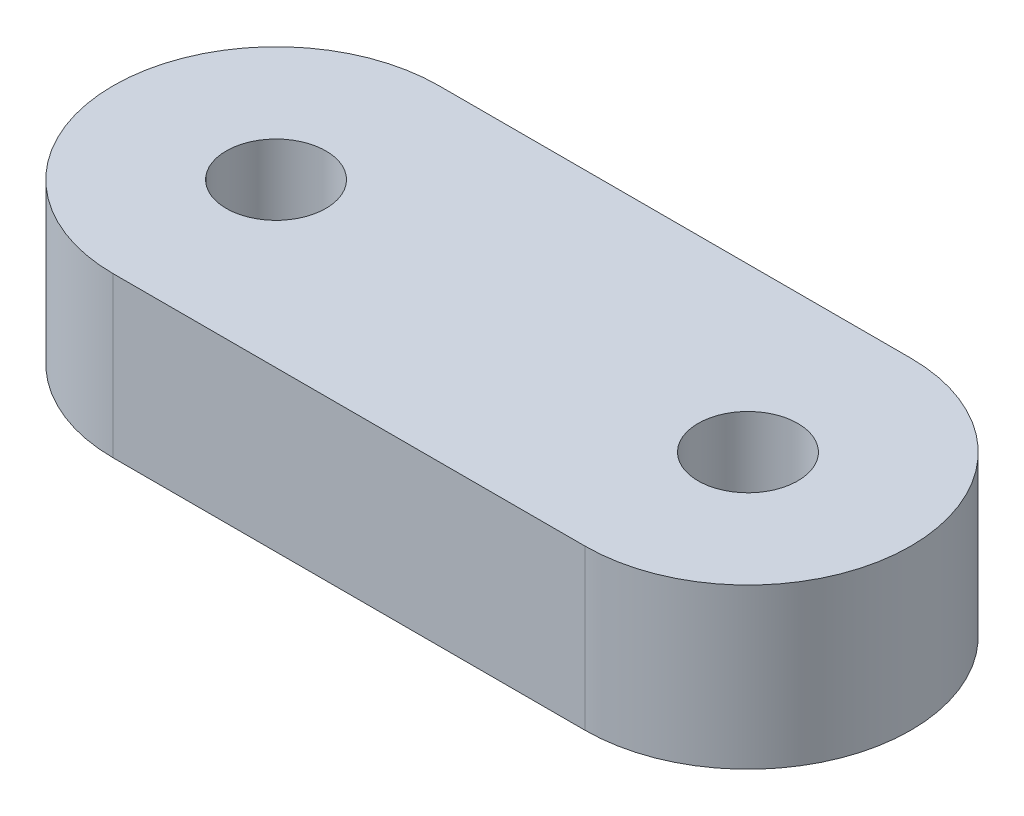
ISO-10303-21;
HEADER;
FILE_DESCRIPTION(('STEP AP214'),'2;1');
FILE_NAME('part.step','',(''),(''),'','','');
FILE_SCHEMA(('AUTOMOTIVE_DESIGN { 1 0 10303 214 1 1 1 1 }'));
ENDSEC;
DATA;
#1=APPLICATION_CONTEXT('core data for automotive mechanical design processes');
#2=APPLICATION_PROTOCOL_DEFINITION('international standard','automotive_design',2000,#1);
#3=PRODUCT_CONTEXT('',#1,'mechanical');
#4=PRODUCT('Part','Part','',(#3));
#5=PRODUCT_RELATED_PRODUCT_CATEGORY('part','',(#4));
#6=PRODUCT_DEFINITION_FORMATION('','',#4);
#7=PRODUCT_DEFINITION_CONTEXT('part definition',#1,'design');
#8=PRODUCT_DEFINITION('design','',#6,#7);
#9=PRODUCT_DEFINITION_SHAPE('','',#8);
#10=(LENGTH_UNIT() NAMED_UNIT(*) SI_UNIT(.MILLI.,.METRE.));
#11=(NAMED_UNIT(*) PLANE_ANGLE_UNIT() SI_UNIT($,.RADIAN.));
#12=(NAMED_UNIT(*) SI_UNIT($,.STERADIAN.) SOLID_ANGLE_UNIT());
#13=UNCERTAINTY_MEASURE_WITH_UNIT(LENGTH_MEASURE(1.E-05),#10,'distance_accuracy_value','');
#14=(GEOMETRIC_REPRESENTATION_CONTEXT(3) GLOBAL_UNCERTAINTY_ASSIGNED_CONTEXT((#13)) GLOBAL_UNIT_ASSIGNED_CONTEXT((#10,
#11,#12)) REPRESENTATION_CONTEXT('',''));
#15=CARTESIAN_POINT('',(0.,0.,0.));
#16=DIRECTION('',(0.,0.,1.));
#17=DIRECTION('',(1.,0.,0.));
#18=AXIS2_PLACEMENT_3D('',#15,#16,#17);
#19=CARTESIAN_POINT('',(7.1,4.8,0.));
#20=DIRECTION('',(0.,1.,0.));
#21=DIRECTION('',(0.,0.,1.));
#22=AXIS2_PLACEMENT_3D('',#19,#20,#21);
#23=PLANE('',#22);
#24=CARTESIAN_POINT('',(-7.1,4.8,0.));
#25=DIRECTION('',(0.,1.,0.));
#26=DIRECTION('',(0.,0.,1.));
#27=AXIS2_PLACEMENT_3D('',#24,#25,#26);
#28=CIRCLE('',#27,1.5);
#29=CARTESIAN_POINT('',(-7.1,4.8,1.5));
#30=VERTEX_POINT('',#29);
#31=EDGE_CURVE('E100',#30,#30,#28,.T.);
#32=ORIENTED_EDGE('',*,*,#31,.F.);
#33=EDGE_LOOP('',(#32));
#34=FACE_BOUND('',#33,.T.);
#35=CARTESIAN_POINT('',(7.1,4.8,0.));
#36=DIRECTION('',(0.,1.,0.));
#37=DIRECTION('',(0.,0.,1.));
#38=AXIS2_PLACEMENT_3D('',#35,#36,#37);
#39=CIRCLE('',#38,4.90000000000003);
#40=CARTESIAN_POINT('',(7.09999944181255,4.8,4.9));
#41=VERTEX_POINT('',#40);
#42=CARTESIAN_POINT('',(7.09999944181255,4.8,-4.9));
#43=VERTEX_POINT('',#42);
#44=EDGE_CURVE('E85',#41,#43,#39,.T.);
#45=ORIENTED_EDGE('',*,*,#44,.T.);
#46=DIRECTION('',(-1.,0.,0.));
#47=VECTOR('',#46,1.);
#48=CARTESIAN_POINT('',(-7.09999944181255,4.8,-4.9));
#49=LINE('',#48,#47);
#50=CARTESIAN_POINT('',(-7.09999944181255,4.8,-4.9));
#51=VERTEX_POINT('',#50);
#52=EDGE_CURVE('E80',#43,#51,#49,.T.);
#53=ORIENTED_EDGE('',*,*,#52,.T.);
#54=CARTESIAN_POINT('',(-7.1,4.8,0.));
#55=DIRECTION('',(0.,1.,0.));
#56=DIRECTION('',(0.,0.,1.));
#57=AXIS2_PLACEMENT_3D('',#54,#55,#56);
#58=CIRCLE('',#57,4.90000000000003);
#59=CARTESIAN_POINT('',(-7.09999944181255,4.8,4.90000000000001));
#60=VERTEX_POINT('',#59);
#61=EDGE_CURVE('E83',#51,#60,#58,.T.);
#62=ORIENTED_EDGE('',*,*,#61,.T.);
#63=DIRECTION('',(1.,0.,0.));
#64=VECTOR('',#63,1.);
#65=CARTESIAN_POINT('',(-7.09999944181255,4.8,4.90000000000001));
#66=LINE('',#65,#64);
#67=EDGE_CURVE('E50',#60,#41,#66,.T.);
#68=ORIENTED_EDGE('',*,*,#67,.T.);
#69=EDGE_LOOP('',(#45,#53,#62,#68));
#70=FACE_BOUND('',#69,.T.);
#71=CARTESIAN_POINT('',(7.1,4.8,0.));
#72=DIRECTION('',(0.,1.,0.));
#73=DIRECTION('',(0.,0.,-1.));
#74=AXIS2_PLACEMENT_3D('',#71,#72,#73);
#75=CIRCLE('',#74,1.5);
#76=CARTESIAN_POINT('',(7.1,4.8,-1.5));
#77=VERTEX_POINT('',#76);
#78=EDGE_CURVE('E115',#77,#77,#75,.T.);
#79=ORIENTED_EDGE('',*,*,#78,.F.);
#80=EDGE_LOOP('',(#79));
#81=FACE_BOUND('',#80,.T.);
#82=ADVANCED_FACE('F33',(#34,#70,#81),#23,.T.);
#83=CARTESIAN_POINT('',(7.1,0.,0.));
#84=DIRECTION('',(0.,1.,0.));
#85=DIRECTION('',(0.,0.,1.));
#86=AXIS2_PLACEMENT_3D('',#83,#84,#85);
#87=PLANE('',#86);
#88=CARTESIAN_POINT('',(-7.1,0.,0.));
#89=DIRECTION('',(0.,1.,0.));
#90=DIRECTION('',(0.,0.,1.));
#91=AXIS2_PLACEMENT_3D('',#88,#89,#90);
#92=CIRCLE('',#91,1.5);
#93=CARTESIAN_POINT('',(-7.1,0.,1.5));
#94=VERTEX_POINT('',#93);
#95=EDGE_CURVE('E112',#94,#94,#92,.T.);
#96=ORIENTED_EDGE('',*,*,#95,.T.);
#97=EDGE_LOOP('',(#96));
#98=FACE_BOUND('',#97,.T.);
#99=CARTESIAN_POINT('',(7.1,0.,0.));
#100=DIRECTION('',(0.,1.,0.));
#101=DIRECTION('',(0.,0.,1.));
#102=AXIS2_PLACEMENT_3D('',#99,#100,#101);
#103=CIRCLE('',#102,4.90000000000003);
#104=CARTESIAN_POINT('',(7.09999944181255,0.,4.9));
#105=VERTEX_POINT('',#104);
#106=CARTESIAN_POINT('',(7.09999944181255,0.,-4.9));
#107=VERTEX_POINT('',#106);
#108=EDGE_CURVE('E97',#105,#107,#103,.T.);
#109=ORIENTED_EDGE('',*,*,#108,.F.);
#110=DIRECTION('',(1.,0.,0.));
#111=VECTOR('',#110,1.);
#112=CARTESIAN_POINT('',(-7.09999944181255,0.,4.90000000000001));
#113=LINE('',#112,#111);
#114=CARTESIAN_POINT('',(-7.09999944181255,0.,4.90000000000001));
#115=VERTEX_POINT('',#114);
#116=EDGE_CURVE('E73',#115,#105,#113,.T.);
#117=ORIENTED_EDGE('',*,*,#116,.F.);
#118=CARTESIAN_POINT('',(-7.1,0.,0.));
#119=DIRECTION('',(0.,1.,0.));
#120=DIRECTION('',(0.,0.,1.));
#121=AXIS2_PLACEMENT_3D('',#118,#119,#120);
#122=CIRCLE('',#121,4.90000000000003);
#123=CARTESIAN_POINT('',(-7.09999944181255,0.,-4.9));
#124=VERTEX_POINT('',#123);
#125=EDGE_CURVE('E67',#124,#115,#122,.T.);
#126=ORIENTED_EDGE('',*,*,#125,.F.);
#127=DIRECTION('',(-1.,0.,0.));
#128=VECTOR('',#127,1.);
#129=CARTESIAN_POINT('',(-7.09999944181255,0.,-4.9));
#130=LINE('',#129,#128);
#131=EDGE_CURVE('E89',#107,#124,#130,.T.);
#132=ORIENTED_EDGE('',*,*,#131,.F.);
#133=EDGE_LOOP('',(#109,#117,#126,#132));
#134=FACE_BOUND('',#133,.T.);
#135=CARTESIAN_POINT('',(7.1,0.,0.));
#136=DIRECTION('',(0.,1.,0.));
#137=DIRECTION('',(0.,0.,-1.));
#138=AXIS2_PLACEMENT_3D('',#135,#136,#137);
#139=CIRCLE('',#138,1.5);
#140=CARTESIAN_POINT('',(7.1,0.,-1.5));
#141=VERTEX_POINT('',#140);
#142=EDGE_CURVE('E118',#141,#141,#139,.T.);
#143=ORIENTED_EDGE('',*,*,#142,.T.);
#144=EDGE_LOOP('',(#143));
#145=FACE_BOUND('',#144,.T.);
#146=ADVANCED_FACE('F108',(#98,#134,#145),#87,.F.);
#147=CARTESIAN_POINT('',(7.1,4.8,0.));
#148=DIRECTION('',(0.,-1.,0.));
#149=DIRECTION('',(0.,0.,-1.));
#150=AXIS2_PLACEMENT_3D('',#147,#148,#149);
#151=CYLINDRICAL_SURFACE('',#150,4.90000000000003);
#152=ORIENTED_EDGE('',*,*,#108,.T.);
#153=DIRECTION('',(0.,-1.,0.));
#154=VECTOR('',#153,1.);
#155=CARTESIAN_POINT('',(7.09999944181255,4.8,-4.9));
#156=LINE('',#155,#154);
#157=EDGE_CURVE('E11',#43,#107,#156,.T.);
#158=ORIENTED_EDGE('',*,*,#157,.F.);
#159=ORIENTED_EDGE('',*,*,#44,.F.);
#160=DIRECTION('',(0.,-1.,0.));
#161=VECTOR('',#160,1.);
#162=CARTESIAN_POINT('',(7.09999944181255,4.8,4.9));
#163=LINE('',#162,#161);
#164=EDGE_CURVE('E93',#41,#105,#163,.T.);
#165=ORIENTED_EDGE('',*,*,#164,.T.);
#166=EDGE_LOOP('',(#152,#158,#159,#165));
#167=FACE_BOUND('',#166,.T.);
#168=ADVANCED_FACE('F35',(#167),#151,.T.);
#169=CARTESIAN_POINT('',(-7.09999944181255,4.8,-4.9));
#170=DIRECTION('',(0.,0.,1.));
#171=DIRECTION('',(1.,0.,0.));
#172=AXIS2_PLACEMENT_3D('',#169,#170,#171);
#173=PLANE('',#172);
#174=ORIENTED_EDGE('',*,*,#131,.T.);
#175=DIRECTION('',(0.,-1.,0.));
#176=VECTOR('',#175,1.);
#177=CARTESIAN_POINT('',(-7.09999944181255,4.8,-4.9));
#178=LINE('',#177,#176);
#179=EDGE_CURVE('E42',#51,#124,#178,.T.);
#180=ORIENTED_EDGE('',*,*,#179,.F.);
#181=ORIENTED_EDGE('',*,*,#52,.F.);
#182=ORIENTED_EDGE('',*,*,#157,.T.);
#183=EDGE_LOOP('',(#174,#180,#181,#182));
#184=FACE_BOUND('',#183,.T.);
#185=ADVANCED_FACE('F88',(#184),#173,.F.);
#186=CARTESIAN_POINT('',(-7.1,4.8,0.));
#187=DIRECTION('',(0.,-1.,0.));
#188=DIRECTION('',(0.,0.,-1.));
#189=AXIS2_PLACEMENT_3D('',#186,#187,#188);
#190=CYLINDRICAL_SURFACE('',#189,4.90000000000003);
#191=ORIENTED_EDGE('',*,*,#125,.T.);
#192=DIRECTION('',(0.,-1.,0.));
#193=VECTOR('',#192,1.);
#194=CARTESIAN_POINT('',(-7.09999944181255,4.8,4.90000000000001));
#195=LINE('',#194,#193);
#196=EDGE_CURVE('E90',#60,#115,#195,.T.);
#197=ORIENTED_EDGE('',*,*,#196,.F.);
#198=ORIENTED_EDGE('',*,*,#61,.F.);
#199=ORIENTED_EDGE('',*,*,#179,.T.);
#200=EDGE_LOOP('',(#191,#197,#198,#199));
#201=FACE_BOUND('',#200,.T.);
#202=ADVANCED_FACE('F91',(#201),#190,.T.);
#203=CARTESIAN_POINT('',(-7.09999944181255,4.8,4.90000000000001));
#204=DIRECTION('',(0.,0.,-1.));
#205=DIRECTION('',(-1.,0.,0.));
#206=AXIS2_PLACEMENT_3D('',#203,#204,#205);
#207=PLANE('',#206);
#208=ORIENTED_EDGE('',*,*,#116,.T.);
#209=ORIENTED_EDGE('',*,*,#164,.F.);
#210=ORIENTED_EDGE('',*,*,#67,.F.);
#211=ORIENTED_EDGE('',*,*,#196,.T.);
#212=EDGE_LOOP('',(#208,#209,#210,#211));
#213=FACE_BOUND('',#212,.T.);
#214=ADVANCED_FACE('F105',(#213),#207,.F.);
#215=CARTESIAN_POINT('',(-7.1,4.8,0.));
#216=DIRECTION('',(0.,-1.,0.));
#217=DIRECTION('',(0.,0.,-1.));
#218=AXIS2_PLACEMENT_3D('',#215,#216,#217);
#219=CYLINDRICAL_SURFACE('',#218,1.5);
#220=ORIENTED_EDGE('',*,*,#31,.T.);
#221=EDGE_LOOP('',(#220));
#222=FACE_BOUND('',#221,.T.);
#223=ORIENTED_EDGE('',*,*,#95,.F.);
#224=EDGE_LOOP('',(#223));
#225=FACE_BOUND('',#224,.T.);
#226=ADVANCED_FACE('F136',(#222,#225),#219,.F.);
#227=CARTESIAN_POINT('',(7.1,4.8,0.));
#228=DIRECTION('',(0.,-1.,0.));
#229=DIRECTION('',(0.,0.,-1.));
#230=AXIS2_PLACEMENT_3D('',#227,#228,#229);
#231=CYLINDRICAL_SURFACE('',#230,1.5);
#232=ORIENTED_EDGE('',*,*,#78,.T.);
#233=EDGE_LOOP('',(#232));
#234=FACE_BOUND('',#233,.T.);
#235=ORIENTED_EDGE('',*,*,#142,.F.);
#236=EDGE_LOOP('',(#235));
#237=FACE_BOUND('',#236,.T.);
#238=ADVANCED_FACE('F124',(#234,#237),#231,.F.);
#239=CLOSED_SHELL('',(#82,#146,#168,#185,#202,#214,#226,#238));
#240=MANIFOLD_SOLID_BREP('B2',#239);
#241=ADVANCED_BREP_SHAPE_REPRESENTATION('',(#18,#240),#14);
#242=SHAPE_DEFINITION_REPRESENTATION(#9,#241);
ENDSEC;
END-ISO-10303-21;
